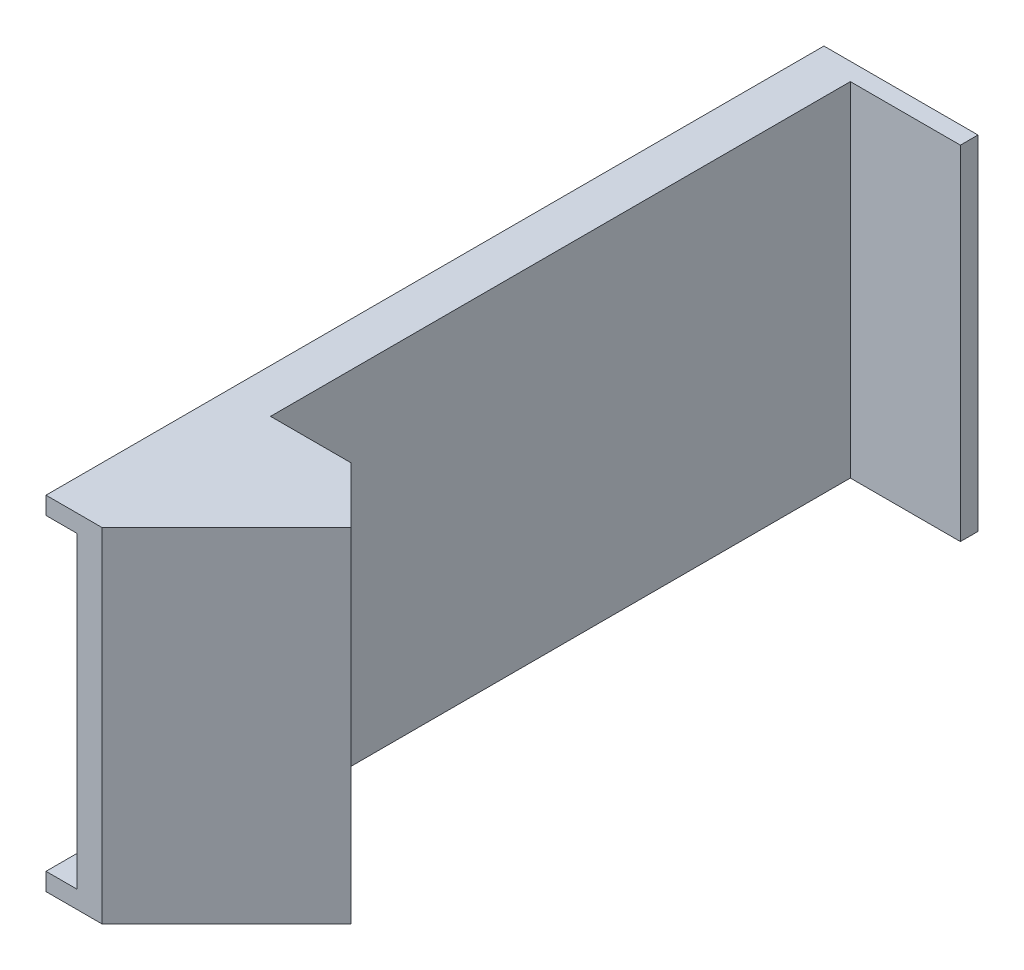
ISO-10303-21;
HEADER;
FILE_DESCRIPTION(('STEP AP214'),'2;1');
FILE_NAME('part.step','',(''),(''),'','','');
FILE_SCHEMA(('AUTOMOTIVE_DESIGN { 1 0 10303 214 1 1 1 1 }'));
ENDSEC;
DATA;
#1=APPLICATION_CONTEXT('core data for automotive mechanical design processes');
#2=APPLICATION_PROTOCOL_DEFINITION('international standard','automotive_design',2000,#1);
#3=PRODUCT_CONTEXT('',#1,'mechanical');
#4=PRODUCT('Part','Part','',(#3));
#5=PRODUCT_RELATED_PRODUCT_CATEGORY('part','',(#4));
#6=PRODUCT_DEFINITION_FORMATION('','',#4);
#7=PRODUCT_DEFINITION_CONTEXT('part definition',#1,'design');
#8=PRODUCT_DEFINITION('design','',#6,#7);
#9=PRODUCT_DEFINITION_SHAPE('','',#8);
#10=(LENGTH_UNIT() NAMED_UNIT(*) SI_UNIT(.MILLI.,.METRE.));
#11=(NAMED_UNIT(*) PLANE_ANGLE_UNIT() SI_UNIT($,.RADIAN.));
#12=(NAMED_UNIT(*) SI_UNIT($,.STERADIAN.) SOLID_ANGLE_UNIT());
#13=UNCERTAINTY_MEASURE_WITH_UNIT(LENGTH_MEASURE(1.E-05),#10,'distance_accuracy_value','');
#14=(GEOMETRIC_REPRESENTATION_CONTEXT(3) GLOBAL_UNCERTAINTY_ASSIGNED_CONTEXT((#13)) GLOBAL_UNIT_ASSIGNED_CONTEXT((#10,
#11,#12)) REPRESENTATION_CONTEXT('',''));
#15=CARTESIAN_POINT('',(0.,0.,0.));
#16=DIRECTION('',(0.,0.,1.));
#17=DIRECTION('',(1.,0.,0.));
#18=AXIS2_PLACEMENT_3D('',#15,#16,#17);
#19=CARTESIAN_POINT('',(0.,0.,2.));
#20=DIRECTION('',(0.,0.,-1.));
#21=DIRECTION('',(-1.,0.,0.));
#22=AXIS2_PLACEMENT_3D('',#19,#20,#21);
#23=PLANE('',#22);
#24=DIRECTION('',(0.,1.,0.));
#25=VECTOR('',#24,1.);
#26=CARTESIAN_POINT('',(2.5,19.5,2.));
#27=LINE('',#26,#25);
#28=CARTESIAN_POINT('',(2.5,-19.5,2.));
#29=VERTEX_POINT('',#28);
#30=CARTESIAN_POINT('',(2.5,19.5,2.));
#31=VERTEX_POINT('',#30);
#32=EDGE_CURVE('E182',#29,#31,#27,.T.);
#33=ORIENTED_EDGE('',*,*,#32,.F.);
#34=DIRECTION('',(1.,0.,0.));
#35=VECTOR('',#34,1.);
#36=CARTESIAN_POINT('',(-15.,-19.5,2.));
#37=LINE('',#36,#35);
#38=CARTESIAN_POINT('',(15.,-19.5,2.));
#39=VERTEX_POINT('',#38);
#40=EDGE_CURVE('E158',#29,#39,#37,.T.);
#41=ORIENTED_EDGE('',*,*,#40,.T.);
#42=DIRECTION('',(0.,1.,0.));
#43=VECTOR('',#42,1.);
#44=CARTESIAN_POINT('',(15.,-19.5,2.));
#45=LINE('',#44,#43);
#46=CARTESIAN_POINT('',(15.,19.5,2.));
#47=VERTEX_POINT('',#46);
#48=EDGE_CURVE('E161',#39,#47,#45,.T.);
#49=ORIENTED_EDGE('',*,*,#48,.T.);
#50=DIRECTION('',(-1.,0.,0.));
#51=VECTOR('',#50,1.);
#52=CARTESIAN_POINT('',(-15.,19.5,2.));
#53=LINE('',#52,#51);
#54=EDGE_CURVE('E170',#47,#31,#53,.T.);
#55=ORIENTED_EDGE('',*,*,#54,.T.);
#56=EDGE_LOOP('',(#33,#41,#49,#55));
#57=FACE_BOUND('',#56,.T.);
#58=ADVANCED_FACE('F33',(#57),#23,.F.);
#59=CARTESIAN_POINT('',(15.,-19.5,2.));
#60=DIRECTION('',(-1.,0.,0.));
#61=DIRECTION('',(0.,0.,1.));
#62=AXIS2_PLACEMENT_3D('',#59,#60,#61);
#63=PLANE('',#62);
#64=DIRECTION('',(0.,1.,0.));
#65=VECTOR('',#64,1.);
#66=CARTESIAN_POINT('',(15.,-19.5,0.));
#67=LINE('',#66,#65);
#68=CARTESIAN_POINT('',(15.,-19.5,0.));
#69=VERTEX_POINT('',#68);
#70=CARTESIAN_POINT('',(15.,19.5,0.));
#71=VERTEX_POINT('',#70);
#72=EDGE_CURVE('E165',#69,#71,#67,.T.);
#73=ORIENTED_EDGE('',*,*,#72,.T.);
#74=DIRECTION('',(0.,0.,-1.));
#75=VECTOR('',#74,1.);
#76=CARTESIAN_POINT('',(15.,19.5,2.));
#77=LINE('',#76,#75);
#78=EDGE_CURVE('E147',#47,#71,#77,.T.);
#79=ORIENTED_EDGE('',*,*,#78,.F.);
#80=ORIENTED_EDGE('',*,*,#48,.F.);
#81=DIRECTION('',(0.,0.,-1.));
#82=VECTOR('',#81,1.);
#83=CARTESIAN_POINT('',(15.,-19.5,2.));
#84=LINE('',#83,#82);
#85=EDGE_CURVE('E155',#39,#69,#84,.T.);
#86=ORIENTED_EDGE('',*,*,#85,.T.);
#87=EDGE_LOOP('',(#73,#79,#80,#86));
#88=FACE_BOUND('',#87,.T.);
#89=ADVANCED_FACE('F35',(#88),#63,.F.);
#90=CARTESIAN_POINT('',(-15.,19.5,2.));
#91=DIRECTION('',(0.,-1.,0.));
#92=DIRECTION('',(0.,0.,-1.));
#93=AXIS2_PLACEMENT_3D('',#90,#91,#92);
#94=PLANE('',#93);
#95=DIRECTION('',(1.,0.,0.));
#96=VECTOR('',#95,1.);
#97=CARTESIAN_POINT('',(11.6421356237309,19.5,67.857864376269));
#98=LINE('',#97,#96);
#99=CARTESIAN_POINT('',(2.49999999999995,19.5,67.857864376269));
#100=VERTEX_POINT('',#99);
#101=CARTESIAN_POINT('',(11.6421356237309,19.5,67.857864376269));
#102=VERTEX_POINT('',#101);
#103=EDGE_CURVE('E231',#100,#102,#98,.T.);
#104=ORIENTED_EDGE('',*,*,#103,.F.);
#105=DIRECTION('',(0.,0.,-1.));
#106=VECTOR('',#105,1.);
#107=CARTESIAN_POINT('',(2.5,19.5,82.));
#108=LINE('',#107,#106);
#109=EDGE_CURVE('E178',#100,#31,#108,.T.);
#110=ORIENTED_EDGE('',*,*,#109,.T.);
#111=ORIENTED_EDGE('',*,*,#54,.F.);
#112=ORIENTED_EDGE('',*,*,#78,.T.);
#113=DIRECTION('',(-1.,0.,0.));
#114=VECTOR('',#113,1.);
#115=CARTESIAN_POINT('',(-15.,19.5,0.));
#116=LINE('',#115,#114);
#117=CARTESIAN_POINT('',(-2.5,19.5,0.));
#118=VERTEX_POINT('',#117);
#119=EDGE_CURVE('E162',#71,#118,#116,.T.);
#120=ORIENTED_EDGE('',*,*,#119,.T.);
#121=DIRECTION('',(0.,0.,-1.));
#122=VECTOR('',#121,1.);
#123=CARTESIAN_POINT('',(-2.5,19.5,82.));
#124=LINE('',#123,#122);
#125=CARTESIAN_POINT('',(-2.50000000000006,19.5,88.3639610306789));
#126=VERTEX_POINT('',#125);
#127=EDGE_CURVE('E180',#126,#118,#124,.T.);
#128=ORIENTED_EDGE('',*,*,#127,.F.);
#129=DIRECTION('',(-1.,0.,0.));
#130=VECTOR('',#129,1.);
#131=CARTESIAN_POINT('',(3.86396103067887,19.5,88.3639610306789));
#132=LINE('',#131,#130);
#133=CARTESIAN_POINT('',(3.86396103067887,19.5,88.3639610306789));
#134=VERTEX_POINT('',#133);
#135=EDGE_CURVE('E225',#134,#126,#132,.T.);
#136=ORIENTED_EDGE('',*,*,#135,.F.);
#137=DIRECTION('',(-0.707106781186548,0.,0.707106781186548));
#138=VECTOR('',#137,1.);
#139=CARTESIAN_POINT('',(3.86396103067887,19.5,88.3639610306789));
#140=LINE('',#139,#138);
#141=CARTESIAN_POINT('',(18.0060966544098,19.5,74.2218254069479));
#142=VERTEX_POINT('',#141);
#143=EDGE_CURVE('E191',#142,#134,#140,.T.);
#144=ORIENTED_EDGE('',*,*,#143,.F.);
#145=DIRECTION('',(-0.707106781186547,0.,-0.707106781186547));
#146=VECTOR('',#145,1.);
#147=CARTESIAN_POINT('',(18.0060966544098,19.5,74.2218254069479));
#148=LINE('',#147,#146);
#149=EDGE_CURVE('E188',#142,#102,#148,.T.);
#150=ORIENTED_EDGE('',*,*,#149,.T.);
#151=EDGE_LOOP('',(#104,#110,#111,#112,#120,#128,#136,#144,#150));
#152=FACE_BOUND('',#151,.T.);
#153=ADVANCED_FACE('F258',(#152),#94,.F.);
#154=CARTESIAN_POINT('',(-15.,-19.5,2.));
#155=DIRECTION('',(0.,1.,0.));
#156=DIRECTION('',(0.,0.,1.));
#157=AXIS2_PLACEMENT_3D('',#154,#155,#156);
#158=PLANE('',#157);
#159=DIRECTION('',(0.,0.,-1.));
#160=VECTOR('',#159,1.);
#161=CARTESIAN_POINT('',(2.5,-19.5,82.));
#162=LINE('',#161,#160);
#163=CARTESIAN_POINT('',(2.49999999999995,-19.5,67.857864376269));
#164=VERTEX_POINT('',#163);
#165=EDGE_CURVE('E176',#164,#29,#162,.T.);
#166=ORIENTED_EDGE('',*,*,#165,.F.);
#167=DIRECTION('',(1.,0.,0.));
#168=VECTOR('',#167,1.);
#169=CARTESIAN_POINT('',(11.6421356237309,-19.5,67.857864376269));
#170=LINE('',#169,#168);
#171=CARTESIAN_POINT('',(11.6421356237309,-19.5,67.857864376269));
#172=VERTEX_POINT('',#171);
#173=EDGE_CURVE('E232',#164,#172,#170,.T.);
#174=ORIENTED_EDGE('',*,*,#173,.T.);
#175=DIRECTION('',(-0.707106781186547,0.,-0.707106781186547));
#176=VECTOR('',#175,1.);
#177=CARTESIAN_POINT('',(18.0060966544098,-19.5,74.2218254069479));
#178=LINE('',#177,#176);
#179=CARTESIAN_POINT('',(18.0060966544098,-19.5,74.2218254069479));
#180=VERTEX_POINT('',#179);
#181=EDGE_CURVE('E185',#180,#172,#178,.T.);
#182=ORIENTED_EDGE('',*,*,#181,.F.);
#183=DIRECTION('',(0.707106781186548,0.,-0.707106781186548));
#184=VECTOR('',#183,1.);
#185=CARTESIAN_POINT('',(3.86396103067887,-19.5,88.3639610306789));
#186=LINE('',#185,#184);
#187=CARTESIAN_POINT('',(3.86396103067887,-19.5,88.3639610306789));
#188=VERTEX_POINT('',#187);
#189=EDGE_CURVE('E200',#188,#180,#186,.T.);
#190=ORIENTED_EDGE('',*,*,#189,.F.);
#191=DIRECTION('',(-1.,0.,0.));
#192=VECTOR('',#191,1.);
#193=CARTESIAN_POINT('',(3.86396103067887,-19.5,88.3639610306789));
#194=LINE('',#193,#192);
#195=CARTESIAN_POINT('',(-2.50000000000006,-19.5,88.3639610306789));
#196=VERTEX_POINT('',#195);
#197=EDGE_CURVE('E222',#188,#196,#194,.T.);
#198=ORIENTED_EDGE('',*,*,#197,.T.);
#199=DIRECTION('',(0.,0.,-1.));
#200=VECTOR('',#199,1.);
#201=CARTESIAN_POINT('',(-2.5,-19.5,82.));
#202=LINE('',#201,#200);
#203=CARTESIAN_POINT('',(-2.5,-19.5,0.));
#204=VERTEX_POINT('',#203);
#205=EDGE_CURVE('E168',#196,#204,#202,.T.);
#206=ORIENTED_EDGE('',*,*,#205,.T.);
#207=DIRECTION('',(1.,0.,0.));
#208=VECTOR('',#207,1.);
#209=CARTESIAN_POINT('',(-15.,-19.5,0.));
#210=LINE('',#209,#208);
#211=EDGE_CURVE('E159',#204,#69,#210,.T.);
#212=ORIENTED_EDGE('',*,*,#211,.T.);
#213=ORIENTED_EDGE('',*,*,#85,.F.);
#214=ORIENTED_EDGE('',*,*,#40,.F.);
#215=EDGE_LOOP('',(#166,#174,#182,#190,#198,#206,#212,#213,#214));
#216=FACE_BOUND('',#215,.T.);
#217=ADVANCED_FACE('F249',(#216),#158,.F.);
#218=CARTESIAN_POINT('',(0.,0.,0.));
#219=DIRECTION('',(0.,0.,-1.));
#220=DIRECTION('',(-1.,0.,0.));
#221=AXIS2_PLACEMENT_3D('',#218,#219,#220);
#222=PLANE('',#221);
#223=DIRECTION('',(0.,1.,0.));
#224=VECTOR('',#223,1.);
#225=CARTESIAN_POINT('',(-2.5,19.5,0.));
#226=LINE('',#225,#224);
#227=EDGE_CURVE('E216',#204,#118,#226,.T.);
#228=ORIENTED_EDGE('',*,*,#227,.T.);
#229=ORIENTED_EDGE('',*,*,#119,.F.);
#230=ORIENTED_EDGE('',*,*,#72,.F.);
#231=ORIENTED_EDGE('',*,*,#211,.F.);
#232=EDGE_LOOP('',(#228,#229,#230,#231));
#233=FACE_BOUND('',#232,.T.);
#234=ADVANCED_FACE('F289',(#233),#222,.T.);
#235=CARTESIAN_POINT('',(-2.5,19.5,82.));
#236=DIRECTION('',(1.,0.,0.));
#237=DIRECTION('',(0.,1.,0.));
#238=AXIS2_PLACEMENT_3D('',#235,#236,#237);
#239=PLANE('',#238);
#240=DIRECTION('',(0.,1.,0.));
#241=VECTOR('',#240,1.);
#242=CARTESIAN_POINT('',(-2.5,19.5,84.8284271247461));
#243=LINE('',#242,#241);
#244=CARTESIAN_POINT('',(-2.5,-17.5,84.8284271247461));
#245=VERTEX_POINT('',#244);
#246=CARTESIAN_POINT('',(-2.5,17.5,84.8284271247461));
#247=VERTEX_POINT('',#246);
#248=EDGE_CURVE('E11',#245,#247,#243,.T.);
#249=ORIENTED_EDGE('',*,*,#248,.T.);
#250=DIRECTION('',(0.,0.,1.));
#251=VECTOR('',#250,1.);
#252=CARTESIAN_POINT('',(-2.5,17.5,82.));
#253=LINE('',#252,#251);
#254=CARTESIAN_POINT('',(-2.50000000000006,17.5,88.3639610306789));
#255=VERTEX_POINT('',#254);
#256=EDGE_CURVE('E235',#247,#255,#253,.T.);
#257=ORIENTED_EDGE('',*,*,#256,.T.);
#258=DIRECTION('',(0.,-1.,0.));
#259=VECTOR('',#258,1.);
#260=CARTESIAN_POINT('',(-2.50000000000006,19.5,88.3639610306789));
#261=LINE('',#260,#259);
#262=EDGE_CURVE('E219',#126,#255,#261,.T.);
#263=ORIENTED_EDGE('',*,*,#262,.F.);
#264=ORIENTED_EDGE('',*,*,#127,.T.);
#265=ORIENTED_EDGE('',*,*,#227,.F.);
#266=ORIENTED_EDGE('',*,*,#205,.F.);
#267=CARTESIAN_POINT('',(-2.50000000000006,-17.5,88.3639610306789));
#268=VERTEX_POINT('',#267);
#269=EDGE_CURVE('E221',#268,#196,#261,.T.);
#270=ORIENTED_EDGE('',*,*,#269,.F.);
#271=DIRECTION('',(0.,0.,-1.));
#272=VECTOR('',#271,1.);
#273=CARTESIAN_POINT('',(-2.5,-17.5,82.));
#274=LINE('',#273,#272);
#275=EDGE_CURVE('E48',#268,#245,#274,.T.);
#276=ORIENTED_EDGE('',*,*,#275,.T.);
#277=EDGE_LOOP('',(#249,#257,#263,#264,#265,#266,#270,#276));
#278=FACE_BOUND('',#277,.T.);
#279=ADVANCED_FACE('F240',(#278),#239,.F.);
#280=CARTESIAN_POINT('',(2.5,19.5,82.));
#281=DIRECTION('',(-1.,0.,0.));
#282=DIRECTION('',(0.,-1.,0.));
#283=AXIS2_PLACEMENT_3D('',#280,#281,#282);
#284=PLANE('',#283);
#285=ORIENTED_EDGE('',*,*,#109,.F.);
#286=DIRECTION('',(0.,-1.,0.));
#287=VECTOR('',#286,1.);
#288=CARTESIAN_POINT('',(2.49999999999995,19.5,67.857864376269));
#289=LINE('',#288,#287);
#290=EDGE_CURVE('E226',#100,#164,#289,.T.);
#291=ORIENTED_EDGE('',*,*,#290,.T.);
#292=ORIENTED_EDGE('',*,*,#165,.T.);
#293=ORIENTED_EDGE('',*,*,#32,.T.);
#294=EDGE_LOOP('',(#285,#291,#292,#293));
#295=FACE_BOUND('',#294,.T.);
#296=ADVANCED_FACE('F315',(#295),#284,.F.);
#297=CARTESIAN_POINT('',(18.0060966544098,19.5,74.2218254069479));
#298=DIRECTION('',(-0.707106781186547,0.,0.707106781186547));
#299=DIRECTION('',(0.707106781186548,0.,0.707106781186548));
#300=AXIS2_PLACEMENT_3D('',#297,#298,#299);
#301=PLANE('',#300);
#302=DIRECTION('',(-0.707106781186547,0.,-0.707106781186548));
#303=VECTOR('',#302,1.);
#304=CARTESIAN_POINT('',(16.5918830920367,-17.5,72.8076118445748));
#305=LINE('',#304,#303);
#306=CARTESIAN_POINT('',(16.5918830920367,-17.5,72.8076118445748));
#307=VERTEX_POINT('',#306);
#308=CARTESIAN_POINT('',(13.056349186104,-17.5,69.2720779386421));
#309=VERTEX_POINT('',#308);
#310=EDGE_CURVE('E213',#307,#309,#305,.T.);
#311=ORIENTED_EDGE('',*,*,#310,.F.);
#312=DIRECTION('',(0.,-1.,0.));
#313=VECTOR('',#312,1.);
#314=CARTESIAN_POINT('',(16.5918830920367,17.5,72.8076118445748));
#315=LINE('',#314,#313);
#316=CARTESIAN_POINT('',(16.5918830920367,17.5,72.8076118445748));
#317=VERTEX_POINT('',#316);
#318=EDGE_CURVE('E56',#317,#307,#315,.T.);
#319=ORIENTED_EDGE('',*,*,#318,.F.);
#320=DIRECTION('',(0.707106781186548,0.,0.707106781186547));
#321=VECTOR('',#320,1.);
#322=CARTESIAN_POINT('',(16.5918830920367,17.5,72.8076118445748));
#323=LINE('',#322,#321);
#324=CARTESIAN_POINT('',(13.056349186104,17.5,69.2720779386421));
#325=VERTEX_POINT('',#324);
#326=EDGE_CURVE('E141',#325,#317,#323,.T.);
#327=ORIENTED_EDGE('',*,*,#326,.F.);
#328=DIRECTION('',(0.,1.,0.));
#329=VECTOR('',#328,1.);
#330=CARTESIAN_POINT('',(13.056349186104,17.5,69.2720779386421));
#331=LINE('',#330,#329);
#332=EDGE_CURVE('E210',#309,#325,#331,.T.);
#333=ORIENTED_EDGE('',*,*,#332,.F.);
#334=EDGE_LOOP('',(#311,#319,#327,#333));
#335=FACE_BOUND('',#334,.T.);
#336=DIRECTION('',(0.,1.,0.));
#337=VECTOR('',#336,1.);
#338=CARTESIAN_POINT('',(11.6421356237309,19.5,67.857864376269));
#339=LINE('',#338,#337);
#340=EDGE_CURVE('E192',#172,#102,#339,.T.);
#341=ORIENTED_EDGE('',*,*,#340,.T.);
#342=ORIENTED_EDGE('',*,*,#149,.F.);
#343=DIRECTION('',(0.,1.,0.));
#344=VECTOR('',#343,1.);
#345=CARTESIAN_POINT('',(18.0060966544098,19.5,74.2218254069479));
#346=LINE('',#345,#344);
#347=EDGE_CURVE('E198',#180,#142,#346,.T.);
#348=ORIENTED_EDGE('',*,*,#347,.F.);
#349=ORIENTED_EDGE('',*,*,#181,.T.);
#350=EDGE_LOOP('',(#341,#342,#348,#349));
#351=FACE_BOUND('',#350,.T.);
#352=ADVANCED_FACE('F266',(#335,#351),#301,.F.);
#353=CARTESIAN_POINT('',(46.1139610306789,0.,46.1139610306789));
#354=DIRECTION('',(0.707106781186548,0.,0.707106781186547));
#355=DIRECTION('',(0.707106781186547,0.,-0.707106781186548));
#356=AXIS2_PLACEMENT_3D('',#353,#354,#355);
#357=PLANE('',#356);
#358=DIRECTION('',(0.,-1.,0.));
#359=VECTOR('',#358,1.);
#360=CARTESIAN_POINT('',(3.86396103067887,19.5,88.3639610306789));
#361=LINE('',#360,#359);
#362=EDGE_CURVE('E195',#134,#188,#361,.T.);
#363=ORIENTED_EDGE('',*,*,#362,.T.);
#364=ORIENTED_EDGE('',*,*,#189,.T.);
#365=ORIENTED_EDGE('',*,*,#347,.T.);
#366=ORIENTED_EDGE('',*,*,#143,.T.);
#367=EDGE_LOOP('',(#363,#364,#365,#366));
#368=FACE_BOUND('',#367,.T.);
#369=ADVANCED_FACE('F253',(#368),#357,.T.);
#370=CARTESIAN_POINT('',(-4.62132034355972,17.5,94.0208152801712));
#371=DIRECTION('',(0.707106781186547,0.,0.707106781186548));
#372=DIRECTION('',(0.707106781186548,0.,-0.707106781186547));
#373=AXIS2_PLACEMENT_3D('',#370,#371,#372);
#374=PLANE('',#373);
#375=DIRECTION('',(0.707106781186548,0.,-0.707106781186547));
#376=VECTOR('',#375,1.);
#377=CARTESIAN_POINT('',(-4.62132034355972,17.5,94.0208152801712));
#378=LINE('',#377,#376);
#379=CARTESIAN_POINT('',(1.03553390593266,17.5,88.3639610306789));
#380=VERTEX_POINT('',#379);
#381=EDGE_CURVE('E196',#380,#317,#378,.T.);
#382=ORIENTED_EDGE('',*,*,#381,.T.);
#383=ORIENTED_EDGE('',*,*,#318,.T.);
#384=DIRECTION('',(0.707106781186548,0.,-0.707106781186547));
#385=VECTOR('',#384,1.);
#386=CARTESIAN_POINT('',(-4.62132034355972,-17.5,94.0208152801712));
#387=LINE('',#386,#385);
#388=CARTESIAN_POINT('',(1.03553390593266,-17.5,88.3639610306789));
#389=VERTEX_POINT('',#388);
#390=EDGE_CURVE('E133',#389,#307,#387,.T.);
#391=ORIENTED_EDGE('',*,*,#390,.F.);
#392=DIRECTION('',(0.,1.,0.));
#393=VECTOR('',#392,1.);
#394=CARTESIAN_POINT('',(1.03553390593266,19.5,88.3639610306789));
#395=LINE('',#394,#393);
#396=EDGE_CURVE('E136',#389,#380,#395,.T.);
#397=ORIENTED_EDGE('',*,*,#396,.T.);
#398=EDGE_LOOP('',(#382,#383,#391,#397));
#399=FACE_BOUND('',#398,.T.);
#400=ADVANCED_FACE('F134',(#399),#374,.F.);
#401=CARTESIAN_POINT('',(-4.62132034355972,17.5,94.0208152801712));
#402=DIRECTION('',(0.,1.,0.));
#403=DIRECTION('',(0.,0.,1.));
#404=AXIS2_PLACEMENT_3D('',#401,#402,#403);
#405=PLANE('',#404);
#406=DIRECTION('',(0.707106781186548,0.,-0.707106781186547));
#407=VECTOR('',#406,1.);
#408=CARTESIAN_POINT('',(-8.15685424949246,17.5,90.4852813742385));
#409=LINE('',#408,#407);
#410=EDGE_CURVE('E205',#247,#325,#409,.T.);
#411=ORIENTED_EDGE('',*,*,#410,.T.);
#412=ORIENTED_EDGE('',*,*,#326,.T.);
#413=ORIENTED_EDGE('',*,*,#381,.F.);
#414=DIRECTION('',(-1.,0.,0.));
#415=VECTOR('',#414,1.);
#416=CARTESIAN_POINT('',(3.86396103067887,17.5,88.3639610306789));
#417=LINE('',#416,#415);
#418=EDGE_CURVE('E41',#380,#255,#417,.T.);
#419=ORIENTED_EDGE('',*,*,#418,.T.);
#420=ORIENTED_EDGE('',*,*,#256,.F.);
#421=EDGE_LOOP('',(#411,#412,#413,#419,#420));
#422=FACE_BOUND('',#421,.T.);
#423=ADVANCED_FACE('F262',(#422),#405,.F.);
#424=CARTESIAN_POINT('',(-8.15685424949246,17.5,90.4852813742385));
#425=DIRECTION('',(-0.707106781186547,0.,-0.707106781186548));
#426=DIRECTION('',(-0.707106781186548,0.,0.707106781186547));
#427=AXIS2_PLACEMENT_3D('',#424,#425,#426);
#428=PLANE('',#427);
#429=DIRECTION('',(0.707106781186548,0.,-0.707106781186547));
#430=VECTOR('',#429,1.);
#431=CARTESIAN_POINT('',(-8.15685424949247,-17.5,90.4852813742385));
#432=LINE('',#431,#430);
#433=EDGE_CURVE('E140',#245,#309,#432,.T.);
#434=ORIENTED_EDGE('',*,*,#433,.T.);
#435=ORIENTED_EDGE('',*,*,#332,.T.);
#436=ORIENTED_EDGE('',*,*,#410,.F.);
#437=ORIENTED_EDGE('',*,*,#248,.F.);
#438=EDGE_LOOP('',(#434,#435,#436,#437));
#439=FACE_BOUND('',#438,.T.);
#440=ADVANCED_FACE('F269',(#439),#428,.F.);
#441=CARTESIAN_POINT('',(-4.62132034355972,-17.5,94.0208152801712));
#442=DIRECTION('',(0.,-1.,0.));
#443=DIRECTION('',(0.,0.,-1.));
#444=AXIS2_PLACEMENT_3D('',#441,#442,#443);
#445=PLANE('',#444);
#446=ORIENTED_EDGE('',*,*,#390,.T.);
#447=ORIENTED_EDGE('',*,*,#310,.T.);
#448=ORIENTED_EDGE('',*,*,#433,.F.);
#449=ORIENTED_EDGE('',*,*,#275,.F.);
#450=DIRECTION('',(1.,0.,0.));
#451=VECTOR('',#450,1.);
#452=CARTESIAN_POINT('',(3.86396103067887,-17.5,88.3639610306789));
#453=LINE('',#452,#451);
#454=EDGE_CURVE('E143',#268,#389,#453,.T.);
#455=ORIENTED_EDGE('',*,*,#454,.T.);
#456=EDGE_LOOP('',(#446,#447,#448,#449,#455));
#457=FACE_BOUND('',#456,.T.);
#458=ADVANCED_FACE('F144',(#457),#445,.F.);
#459=CARTESIAN_POINT('',(3.86396103067887,19.5,88.3639610306789));
#460=DIRECTION('',(0.,0.,1.));
#461=DIRECTION('',(1.,0.,0.));
#462=AXIS2_PLACEMENT_3D('',#459,#460,#461);
#463=PLANE('',#462);
#464=ORIENTED_EDGE('',*,*,#418,.F.);
#465=ORIENTED_EDGE('',*,*,#396,.F.);
#466=ORIENTED_EDGE('',*,*,#454,.F.);
#467=ORIENTED_EDGE('',*,*,#269,.T.);
#468=ORIENTED_EDGE('',*,*,#197,.F.);
#469=ORIENTED_EDGE('',*,*,#362,.F.);
#470=ORIENTED_EDGE('',*,*,#135,.T.);
#471=ORIENTED_EDGE('',*,*,#262,.T.);
#472=EDGE_LOOP('',(#464,#465,#466,#467,#468,#469,#470,#471));
#473=FACE_BOUND('',#472,.T.);
#474=ADVANCED_FACE('F149',(#473),#463,.T.);
#475=CARTESIAN_POINT('',(11.6421356237309,19.5,67.857864376269));
#476=DIRECTION('',(0.,0.,-1.));
#477=DIRECTION('',(-1.,0.,0.));
#478=AXIS2_PLACEMENT_3D('',#475,#476,#477);
#479=PLANE('',#478);
#480=ORIENTED_EDGE('',*,*,#173,.F.);
#481=ORIENTED_EDGE('',*,*,#290,.F.);
#482=ORIENTED_EDGE('',*,*,#103,.T.);
#483=ORIENTED_EDGE('',*,*,#340,.F.);
#484=EDGE_LOOP('',(#480,#481,#482,#483));
#485=FACE_BOUND('',#484,.T.);
#486=ADVANCED_FACE('F363',(#485),#479,.T.);
#487=CLOSED_SHELL('',(#58,#89,#153,#217,#234,#279,#296,#352,#369,#400,#423,#440,#458,#474,#486));
#488=MANIFOLD_SOLID_BREP('B2',#487);
#489=ADVANCED_BREP_SHAPE_REPRESENTATION('',(#18,#488),#14);
#490=SHAPE_DEFINITION_REPRESENTATION(#9,#489);
ENDSEC;
END-ISO-10303-21;
